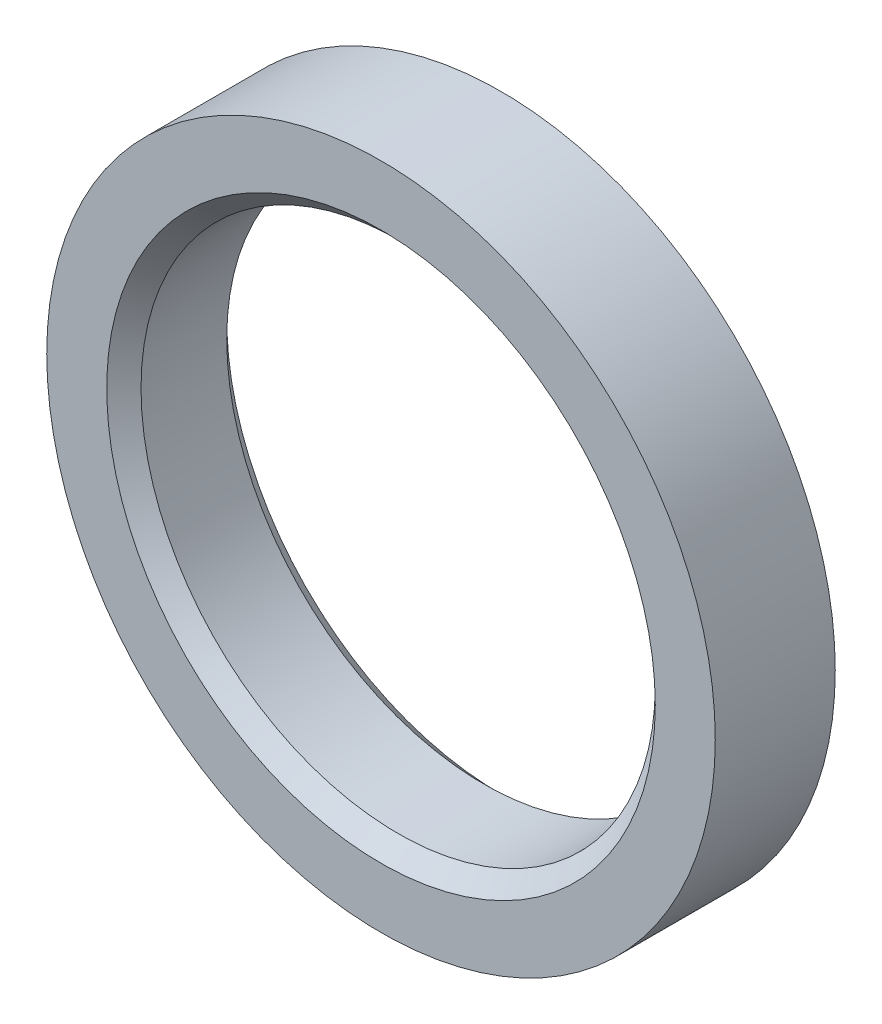
ISO-10303-21;
HEADER;
FILE_DESCRIPTION(('STEP AP214'),'2;1');
FILE_NAME('part.step','',(''),(''),'','','');
FILE_SCHEMA(('AUTOMOTIVE_DESIGN { 1 0 10303 214 1 1 1 1 }'));
ENDSEC;
DATA;
#1=APPLICATION_CONTEXT('core data for automotive mechanical design processes');
#2=APPLICATION_PROTOCOL_DEFINITION('international standard','automotive_design',2000,#1);
#3=PRODUCT_CONTEXT('',#1,'mechanical');
#4=PRODUCT('Part','Part','',(#3));
#5=PRODUCT_RELATED_PRODUCT_CATEGORY('part','',(#4));
#6=PRODUCT_DEFINITION_FORMATION('','',#4);
#7=PRODUCT_DEFINITION_CONTEXT('part definition',#1,'design');
#8=PRODUCT_DEFINITION('design','',#6,#7);
#9=PRODUCT_DEFINITION_SHAPE('','',#8);
#10=(LENGTH_UNIT() NAMED_UNIT(*) SI_UNIT(.MILLI.,.METRE.));
#11=(NAMED_UNIT(*) PLANE_ANGLE_UNIT() SI_UNIT($,.RADIAN.));
#12=(NAMED_UNIT(*) SI_UNIT($,.STERADIAN.) SOLID_ANGLE_UNIT());
#13=UNCERTAINTY_MEASURE_WITH_UNIT(LENGTH_MEASURE(1.E-05),#10,'distance_accuracy_value','');
#14=(GEOMETRIC_REPRESENTATION_CONTEXT(3) GLOBAL_UNCERTAINTY_ASSIGNED_CONTEXT((#13)) GLOBAL_UNIT_ASSIGNED_CONTEXT((#10,
#11,#12)) REPRESENTATION_CONTEXT('',''));
#15=CARTESIAN_POINT('',(0.,0.,0.));
#16=DIRECTION('',(0.,0.,1.));
#17=DIRECTION('',(1.,0.,0.));
#18=AXIS2_PLACEMENT_3D('',#15,#16,#17);
#19=CARTESIAN_POINT('',(0.,0.,7.));
#20=DIRECTION('',(0.,0.,-1.));
#21=DIRECTION('',(-1.,0.,0.));
#22=AXIS2_PLACEMENT_3D('',#19,#20,#21);
#23=CYLINDRICAL_SURFACE('',#22,15.);
#24=CARTESIAN_POINT('',(0.,0.,6.00000000000001));
#25=DIRECTION('',(0.,0.,1.));
#26=DIRECTION('',(1.,0.,0.));
#27=AXIS2_PLACEMENT_3D('',#24,#25,#26);
#28=CIRCLE('',#27,15.);
#29=CARTESIAN_POINT('',(15.,0.,6.00000000000001));
#30=VERTEX_POINT('',#29);
#31=EDGE_CURVE('E46',#30,#30,#28,.T.);
#32=ORIENTED_EDGE('',*,*,#31,.T.);
#33=EDGE_LOOP('',(#32));
#34=FACE_BOUND('',#33,.T.);
#35=CARTESIAN_POINT('',(0.,0.,1.00000000000001));
#36=DIRECTION('',(0.,0.,1.));
#37=DIRECTION('',(1.,0.,0.));
#38=AXIS2_PLACEMENT_3D('',#35,#36,#37);
#39=CIRCLE('',#38,15.);
#40=CARTESIAN_POINT('',(15.,0.,1.00000000000001));
#41=VERTEX_POINT('',#40);
#42=EDGE_CURVE('E50',#41,#41,#39,.F.);
#43=ORIENTED_EDGE('',*,*,#42,.T.);
#44=EDGE_LOOP('',(#43));
#45=FACE_BOUND('',#44,.T.);
#46=ADVANCED_FACE('F35',(#34,#45),#23,.F.);
#47=CARTESIAN_POINT('',(0.,0.,7.));
#48=DIRECTION('',(0.,0.,-1.));
#49=DIRECTION('',(-1.,0.,0.));
#50=AXIS2_PLACEMENT_3D('',#47,#48,#49);
#51=CYLINDRICAL_SURFACE('',#50,19.5);
#52=CARTESIAN_POINT('',(0.,0.,7.));
#53=DIRECTION('',(0.,0.,1.));
#54=DIRECTION('',(1.,0.,0.));
#55=AXIS2_PLACEMENT_3D('',#52,#53,#54);
#56=CIRCLE('',#55,19.5);
#57=CARTESIAN_POINT('',(19.5,0.,7.));
#58=VERTEX_POINT('',#57);
#59=EDGE_CURVE('E55',#58,#58,#56,.T.);
#60=ORIENTED_EDGE('',*,*,#59,.F.);
#61=EDGE_LOOP('',(#60));
#62=FACE_BOUND('',#61,.T.);
#63=CARTESIAN_POINT('',(0.,0.,0.));
#64=DIRECTION('',(0.,0.,1.));
#65=DIRECTION('',(1.,0.,0.));
#66=AXIS2_PLACEMENT_3D('',#63,#64,#65);
#67=CIRCLE('',#66,19.5);
#68=CARTESIAN_POINT('',(19.5,0.,0.));
#69=VERTEX_POINT('',#68);
#70=EDGE_CURVE('E56',#69,#69,#67,.T.);
#71=ORIENTED_EDGE('',*,*,#70,.T.);
#72=EDGE_LOOP('',(#71));
#73=FACE_BOUND('',#72,.T.);
#74=ADVANCED_FACE('F64',(#62,#73),#51,.T.);
#75=CARTESIAN_POINT('',(0.,0.,7.));
#76=DIRECTION('',(0.,0.,1.));
#77=DIRECTION('',(1.,0.,0.));
#78=AXIS2_PLACEMENT_3D('',#75,#76,#77);
#79=PLANE('',#78);
#80=CARTESIAN_POINT('',(0.,0.,7.));
#81=DIRECTION('',(0.,0.,1.));
#82=DIRECTION('',(1.,0.,0.));
#83=AXIS2_PLACEMENT_3D('',#80,#81,#82);
#84=CIRCLE('',#83,16.);
#85=CARTESIAN_POINT('',(16.,0.,7.));
#86=VERTEX_POINT('',#85);
#87=EDGE_CURVE('E42',#86,#86,#84,.F.);
#88=ORIENTED_EDGE('',*,*,#87,.T.);
#89=EDGE_LOOP('',(#88));
#90=FACE_BOUND('',#89,.T.);
#91=ORIENTED_EDGE('',*,*,#59,.T.);
#92=EDGE_LOOP('',(#91));
#93=FACE_BOUND('',#92,.T.);
#94=ADVANCED_FACE('F62',(#90,#93),#79,.T.);
#95=CARTESIAN_POINT('',(0.,0.,0.));
#96=DIRECTION('',(0.,0.,1.));
#97=DIRECTION('',(1.,0.,0.));
#98=AXIS2_PLACEMENT_3D('',#95,#96,#97);
#99=PLANE('',#98);
#100=CARTESIAN_POINT('',(0.,0.,0.));
#101=DIRECTION('',(0.,0.,1.));
#102=DIRECTION('',(1.,0.,0.));
#103=AXIS2_PLACEMENT_3D('',#100,#101,#102);
#104=CIRCLE('',#103,16.);
#105=CARTESIAN_POINT('',(16.,0.,0.));
#106=VERTEX_POINT('',#105);
#107=EDGE_CURVE('E10',#106,#106,#104,.T.);
#108=ORIENTED_EDGE('',*,*,#107,.T.);
#109=EDGE_LOOP('',(#108));
#110=FACE_BOUND('',#109,.T.);
#111=ORIENTED_EDGE('',*,*,#70,.F.);
#112=EDGE_LOOP('',(#111));
#113=FACE_BOUND('',#112,.T.);
#114=ADVANCED_FACE('F70',(#110,#113),#99,.F.);
#115=CARTESIAN_POINT('',(0.,0.,6.00000000000001));
#116=DIRECTION('',(0.,0.,1.));
#117=DIRECTION('',(1.,0.,0.));
#118=AXIS2_PLACEMENT_3D('',#115,#116,#117);
#119=CONICAL_SURFACE('',#118,15.,0.785398163397448);
#120=ORIENTED_EDGE('',*,*,#87,.F.);
#121=EDGE_LOOP('',(#120));
#122=FACE_BOUND('',#121,.T.);
#123=ORIENTED_EDGE('',*,*,#31,.F.);
#124=EDGE_LOOP('',(#123));
#125=FACE_BOUND('',#124,.T.);
#126=ADVANCED_FACE('F72',(#122,#125),#119,.F.);
#127=CARTESIAN_POINT('',(0.,0.,0.));
#128=DIRECTION('',(0.,0.,-1.));
#129=DIRECTION('',(-1.,0.,0.));
#130=AXIS2_PLACEMENT_3D('',#127,#128,#129);
#131=CONICAL_SURFACE('',#130,16.,0.785398163397448);
#132=ORIENTED_EDGE('',*,*,#42,.F.);
#133=EDGE_LOOP('',(#132));
#134=FACE_BOUND('',#133,.T.);
#135=ORIENTED_EDGE('',*,*,#107,.F.);
#136=EDGE_LOOP('',(#135));
#137=FACE_BOUND('',#136,.T.);
#138=ADVANCED_FACE('F37',(#134,#137),#131,.F.);
#139=CLOSED_SHELL('',(#46,#74,#94,#114,#126,#138));
#140=MANIFOLD_SOLID_BREP('B2',#139);
#141=ADVANCED_BREP_SHAPE_REPRESENTATION('',(#18,#140),#14);
#142=SHAPE_DEFINITION_REPRESENTATION(#9,#141);
ENDSEC;
END-ISO-10303-21;
